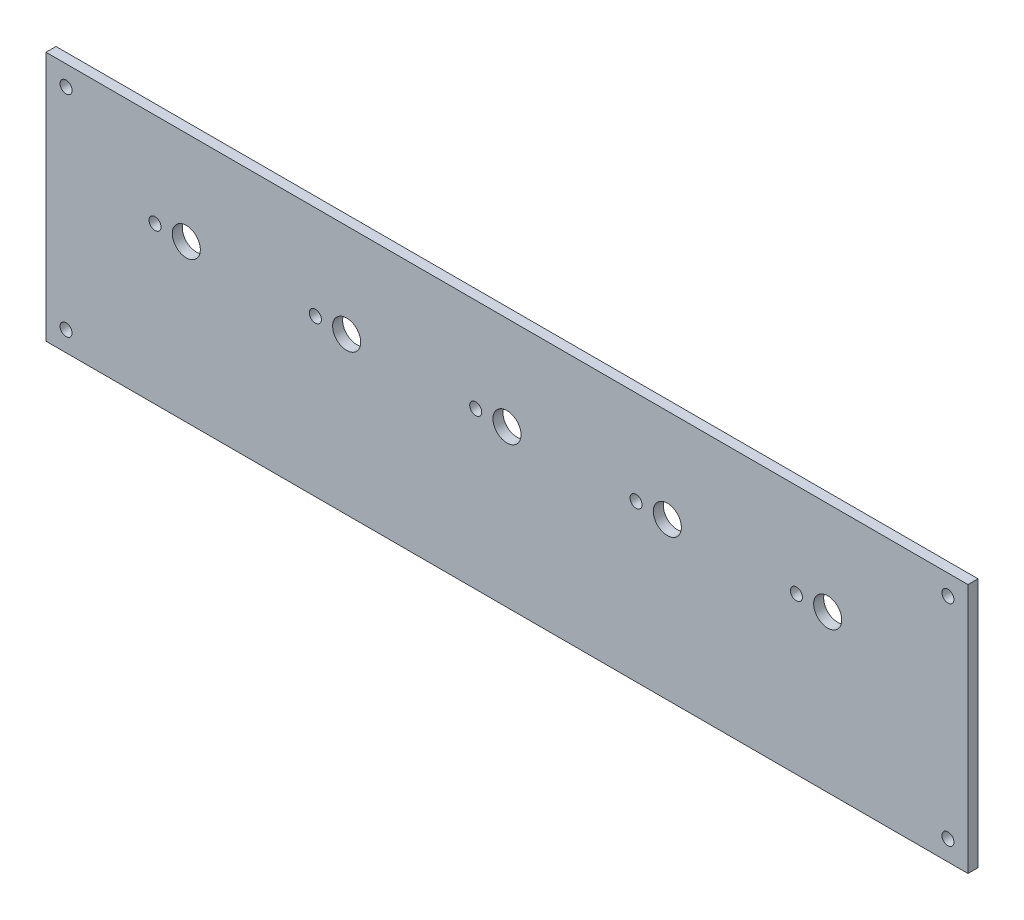
ISO-10303-21;
HEADER;
FILE_DESCRIPTION(('STEP AP214'),'2;1');
FILE_NAME('part.step','',(''),(''),'','','');
FILE_SCHEMA(('AUTOMOTIVE_DESIGN { 1 0 10303 214 1 1 1 1 }'));
ENDSEC;
DATA;
#1=APPLICATION_CONTEXT('core data for automotive mechanical design processes');
#2=APPLICATION_PROTOCOL_DEFINITION('international standard','automotive_design',2000,#1);
#3=PRODUCT_CONTEXT('',#1,'mechanical');
#4=PRODUCT('Part','Part','',(#3));
#5=PRODUCT_RELATED_PRODUCT_CATEGORY('part','',(#4));
#6=PRODUCT_DEFINITION_FORMATION('','',#4);
#7=PRODUCT_DEFINITION_CONTEXT('part definition',#1,'design');
#8=PRODUCT_DEFINITION('design','',#6,#7);
#9=PRODUCT_DEFINITION_SHAPE('','',#8);
#10=(LENGTH_UNIT() NAMED_UNIT(*) SI_UNIT(.MILLI.,.METRE.));
#11=(NAMED_UNIT(*) PLANE_ANGLE_UNIT() SI_UNIT($,.RADIAN.));
#12=(NAMED_UNIT(*) SI_UNIT($,.STERADIAN.) SOLID_ANGLE_UNIT());
#13=UNCERTAINTY_MEASURE_WITH_UNIT(LENGTH_MEASURE(1.E-05),#10,'distance_accuracy_value','');
#14=(GEOMETRIC_REPRESENTATION_CONTEXT(3) GLOBAL_UNCERTAINTY_ASSIGNED_CONTEXT((#13)) GLOBAL_UNIT_ASSIGNED_CONTEXT((#10,
#11,#12)) REPRESENTATION_CONTEXT('',''));
#15=CARTESIAN_POINT('',(0.,0.,0.));
#16=DIRECTION('',(0.,0.,1.));
#17=DIRECTION('',(1.,0.,0.));
#18=AXIS2_PLACEMENT_3D('',#15,#16,#17);
#19=CARTESIAN_POINT('',(0.,0.,2.5));
#20=DIRECTION('',(1.,0.,0.));
#21=DIRECTION('',(0.,0.,-1.));
#22=AXIS2_PLACEMENT_3D('',#19,#20,#21);
#23=PLANE('',#22);
#24=DIRECTION('',(0.,-1.,0.));
#25=VECTOR('',#24,1.);
#26=CARTESIAN_POINT('',(0.,0.,0.));
#27=LINE('',#26,#25);
#28=CARTESIAN_POINT('',(0.,62.43,0.));
#29=VERTEX_POINT('',#28);
#30=CARTESIAN_POINT('',(0.,0.,0.));
#31=VERTEX_POINT('',#30);
#32=EDGE_CURVE('E99',#29,#31,#27,.T.);
#33=ORIENTED_EDGE('',*,*,#32,.T.);
#34=DIRECTION('',(0.,0.,-1.));
#35=VECTOR('',#34,1.);
#36=CARTESIAN_POINT('',(0.,0.,2.5));
#37=LINE('',#36,#35);
#38=CARTESIAN_POINT('',(0.,0.,2.5));
#39=VERTEX_POINT('',#38);
#40=EDGE_CURVE('E11',#39,#31,#37,.T.);
#41=ORIENTED_EDGE('',*,*,#40,.F.);
#42=DIRECTION('',(0.,-1.,0.));
#43=VECTOR('',#42,1.);
#44=CARTESIAN_POINT('',(0.,0.,2.5));
#45=LINE('',#44,#43);
#46=CARTESIAN_POINT('',(0.,62.43,2.5));
#47=VERTEX_POINT('',#46);
#48=EDGE_CURVE('E86',#47,#39,#45,.T.);
#49=ORIENTED_EDGE('',*,*,#48,.F.);
#50=DIRECTION('',(0.,0.,-1.));
#51=VECTOR('',#50,1.);
#52=CARTESIAN_POINT('',(0.,62.43,2.5));
#53=LINE('',#52,#51);
#54=EDGE_CURVE('E95',#47,#29,#53,.T.);
#55=ORIENTED_EDGE('',*,*,#54,.T.);
#56=EDGE_LOOP('',(#33,#41,#49,#55));
#57=FACE_BOUND('',#56,.T.);
#58=ADVANCED_FACE('F33',(#57),#23,.F.);
#59=CARTESIAN_POINT('',(0.,0.,2.5));
#60=DIRECTION('',(0.,1.,0.));
#61=DIRECTION('',(0.,0.,1.));
#62=AXIS2_PLACEMENT_3D('',#59,#60,#61);
#63=PLANE('',#62);
#64=DIRECTION('',(1.,0.,0.));
#65=VECTOR('',#64,1.);
#66=CARTESIAN_POINT('',(0.,0.,0.));
#67=LINE('',#66,#65);
#68=CARTESIAN_POINT('',(230.,0.,0.));
#69=VERTEX_POINT('',#68);
#70=EDGE_CURVE('E90',#31,#69,#67,.T.);
#71=ORIENTED_EDGE('',*,*,#70,.T.);
#72=DIRECTION('',(0.,0.,-1.));
#73=VECTOR('',#72,1.);
#74=CARTESIAN_POINT('',(230.,0.,2.5));
#75=LINE('',#74,#73);
#76=CARTESIAN_POINT('',(230.,0.,2.5));
#77=VERTEX_POINT('',#76);
#78=EDGE_CURVE('E42',#77,#69,#75,.T.);
#79=ORIENTED_EDGE('',*,*,#78,.F.);
#80=DIRECTION('',(1.,0.,0.));
#81=VECTOR('',#80,1.);
#82=CARTESIAN_POINT('',(0.,0.,2.5));
#83=LINE('',#82,#81);
#84=EDGE_CURVE('E81',#39,#77,#83,.T.);
#85=ORIENTED_EDGE('',*,*,#84,.F.);
#86=ORIENTED_EDGE('',*,*,#40,.T.);
#87=EDGE_LOOP('',(#71,#79,#85,#86));
#88=FACE_BOUND('',#87,.T.);
#89=ADVANCED_FACE('F89',(#88),#63,.F.);
#90=CARTESIAN_POINT('',(230.,0.,2.5));
#91=DIRECTION('',(-1.,0.,0.));
#92=DIRECTION('',(0.,0.,1.));
#93=AXIS2_PLACEMENT_3D('',#90,#91,#92);
#94=PLANE('',#93);
#95=DIRECTION('',(0.,1.,0.));
#96=VECTOR('',#95,1.);
#97=CARTESIAN_POINT('',(230.,0.,0.));
#98=LINE('',#97,#96);
#99=CARTESIAN_POINT('',(230.,62.43,0.));
#100=VERTEX_POINT('',#99);
#101=EDGE_CURVE('E68',#69,#100,#98,.T.);
#102=ORIENTED_EDGE('',*,*,#101,.T.);
#103=DIRECTION('',(0.,0.,-1.));
#104=VECTOR('',#103,1.);
#105=CARTESIAN_POINT('',(230.,62.43,2.5));
#106=LINE('',#105,#104);
#107=CARTESIAN_POINT('',(230.,62.43,2.5));
#108=VERTEX_POINT('',#107);
#109=EDGE_CURVE('E91',#108,#100,#106,.T.);
#110=ORIENTED_EDGE('',*,*,#109,.F.);
#111=DIRECTION('',(0.,1.,0.));
#112=VECTOR('',#111,1.);
#113=CARTESIAN_POINT('',(230.,0.,2.5));
#114=LINE('',#113,#112);
#115=EDGE_CURVE('E84',#77,#108,#114,.T.);
#116=ORIENTED_EDGE('',*,*,#115,.F.);
#117=ORIENTED_EDGE('',*,*,#78,.T.);
#118=EDGE_LOOP('',(#102,#110,#116,#117));
#119=FACE_BOUND('',#118,.T.);
#120=ADVANCED_FACE('F93',(#119),#94,.F.);
#121=CARTESIAN_POINT('',(0.,62.43,2.5));
#122=DIRECTION('',(0.,-1.,0.));
#123=DIRECTION('',(0.,0.,-1.));
#124=AXIS2_PLACEMENT_3D('',#121,#122,#123);
#125=PLANE('',#124);
#126=DIRECTION('',(-1.,0.,0.));
#127=VECTOR('',#126,1.);
#128=CARTESIAN_POINT('',(0.,62.43,0.));
#129=LINE('',#128,#127);
#130=EDGE_CURVE('E74',#100,#29,#129,.T.);
#131=ORIENTED_EDGE('',*,*,#130,.T.);
#132=ORIENTED_EDGE('',*,*,#54,.F.);
#133=DIRECTION('',(-1.,0.,0.));
#134=VECTOR('',#133,1.);
#135=CARTESIAN_POINT('',(0.,62.43,2.5));
#136=LINE('',#135,#134);
#137=EDGE_CURVE('E51',#108,#47,#136,.T.);
#138=ORIENTED_EDGE('',*,*,#137,.F.);
#139=ORIENTED_EDGE('',*,*,#109,.T.);
#140=EDGE_LOOP('',(#131,#132,#138,#139));
#141=FACE_BOUND('',#140,.T.);
#142=ADVANCED_FACE('F136',(#141),#125,.F.);
#143=CARTESIAN_POINT('',(0.,0.,2.5));
#144=DIRECTION('',(0.,0.,-1.));
#145=DIRECTION('',(-1.,0.,0.));
#146=AXIS2_PLACEMENT_3D('',#143,#144,#145);
#147=PLANE('',#146);
#148=CARTESIAN_POINT('',(27.2,39.0187499999994,2.5));
#149=DIRECTION('',(0.,0.,1.));
#150=DIRECTION('',(1.,0.,0.));
#151=AXIS2_PLACEMENT_3D('',#148,#149,#150);
#152=CIRCLE('',#151,1.5);
#153=CARTESIAN_POINT('',(28.7,39.0187499999994,2.5));
#154=VERTEX_POINT('',#153);
#155=EDGE_CURVE('E315',#154,#154,#152,.T.);
#156=ORIENTED_EDGE('',*,*,#155,.F.);
#157=EDGE_LOOP('',(#156));
#158=FACE_BOUND('',#157,.T.);
#159=CARTESIAN_POINT('',(195.,39.01875,2.5));
#160=DIRECTION('',(0.,0.,1.));
#161=DIRECTION('',(1.,0.,0.));
#162=AXIS2_PLACEMENT_3D('',#159,#160,#161);
#163=CIRCLE('',#162,3.49999999999999);
#164=CARTESIAN_POINT('',(198.5,39.01875,2.5));
#165=VERTEX_POINT('',#164);
#166=EDGE_CURVE('E404',#165,#165,#163,.T.);
#167=ORIENTED_EDGE('',*,*,#166,.F.);
#168=EDGE_LOOP('',(#167));
#169=FACE_BOUND('',#168,.T.);
#170=CARTESIAN_POINT('',(147.2,39.01875,2.5));
#171=DIRECTION('',(0.,0.,1.));
#172=DIRECTION('',(1.,0.,0.));
#173=AXIS2_PLACEMENT_3D('',#170,#171,#172);
#174=CIRCLE('',#173,1.5);
#175=CARTESIAN_POINT('',(148.7,39.01875,2.5));
#176=VERTEX_POINT('',#175);
#177=EDGE_CURVE('E398',#176,#176,#174,.T.);
#178=ORIENTED_EDGE('',*,*,#177,.F.);
#179=EDGE_LOOP('',(#178));
#180=FACE_BOUND('',#179,.T.);
#181=CARTESIAN_POINT('',(155.,39.01875,2.5));
#182=DIRECTION('',(0.,0.,1.));
#183=DIRECTION('',(1.,0.,0.));
#184=AXIS2_PLACEMENT_3D('',#181,#182,#183);
#185=CIRCLE('',#184,3.49999999999999);
#186=CARTESIAN_POINT('',(158.5,39.01875,2.5));
#187=VERTEX_POINT('',#186);
#188=EDGE_CURVE('E369',#187,#187,#185,.T.);
#189=ORIENTED_EDGE('',*,*,#188,.F.);
#190=EDGE_LOOP('',(#189));
#191=FACE_BOUND('',#190,.T.);
#192=CARTESIAN_POINT('',(107.2,39.01875,2.5));
#193=DIRECTION('',(0.,0.,1.));
#194=DIRECTION('',(1.,0.,0.));
#195=AXIS2_PLACEMENT_3D('',#192,#193,#194);
#196=CIRCLE('',#195,1.5);
#197=CARTESIAN_POINT('',(108.7,39.01875,2.5));
#198=VERTEX_POINT('',#197);
#199=EDGE_CURVE('E360',#198,#198,#196,.T.);
#200=ORIENTED_EDGE('',*,*,#199,.F.);
#201=EDGE_LOOP('',(#200));
#202=FACE_BOUND('',#201,.T.);
#203=CARTESIAN_POINT('',(187.2,39.01875,2.5));
#204=DIRECTION('',(0.,0.,1.));
#205=DIRECTION('',(1.,0.,0.));
#206=AXIS2_PLACEMENT_3D('',#203,#204,#205);
#207=CIRCLE('',#206,1.5);
#208=CARTESIAN_POINT('',(188.7,39.01875,2.5));
#209=VERTEX_POINT('',#208);
#210=EDGE_CURVE('E414',#209,#209,#207,.T.);
#211=ORIENTED_EDGE('',*,*,#210,.F.);
#212=EDGE_LOOP('',(#211));
#213=FACE_BOUND('',#212,.T.);
#214=CARTESIAN_POINT('',(75.,39.0187499999997,2.5));
#215=DIRECTION('',(0.,0.,1.));
#216=DIRECTION('',(1.,0.,0.));
#217=AXIS2_PLACEMENT_3D('',#214,#215,#216);
#218=CIRCLE('',#217,3.50000000000001);
#219=CARTESIAN_POINT('',(78.5,39.0187499999997,2.5));
#220=VERTEX_POINT('',#219);
#221=EDGE_CURVE('E419',#220,#220,#218,.T.);
#222=ORIENTED_EDGE('',*,*,#221,.F.);
#223=EDGE_LOOP('',(#222));
#224=FACE_BOUND('',#223,.T.);
#225=CARTESIAN_POINT('',(67.2,39.0187499999997,2.5));
#226=DIRECTION('',(0.,0.,1.));
#227=DIRECTION('',(1.,0.,0.));
#228=AXIS2_PLACEMENT_3D('',#225,#226,#227);
#229=CIRCLE('',#228,1.5);
#230=CARTESIAN_POINT('',(68.7,39.0187499999997,2.5));
#231=VERTEX_POINT('',#230);
#232=EDGE_CURVE('E392',#231,#231,#229,.T.);
#233=ORIENTED_EDGE('',*,*,#232,.F.);
#234=EDGE_LOOP('',(#233));
#235=FACE_BOUND('',#234,.T.);
#236=CARTESIAN_POINT('',(35.,39.0187499999994,2.5));
#237=DIRECTION('',(0.,0.,1.));
#238=DIRECTION('',(1.,0.,0.));
#239=AXIS2_PLACEMENT_3D('',#236,#237,#238);
#240=CIRCLE('',#239,3.5);
#241=CARTESIAN_POINT('',(38.5,39.0187499999994,2.5));
#242=VERTEX_POINT('',#241);
#243=EDGE_CURVE('E319',#242,#242,#240,.T.);
#244=ORIENTED_EDGE('',*,*,#243,.F.);
#245=EDGE_LOOP('',(#244));
#246=FACE_BOUND('',#245,.T.);
#247=CARTESIAN_POINT('',(115.,39.01875,2.5));
#248=DIRECTION('',(0.,0.,1.));
#249=DIRECTION('',(1.,0.,0.));
#250=AXIS2_PLACEMENT_3D('',#247,#248,#249);
#251=CIRCLE('',#250,3.50000000000001);
#252=CARTESIAN_POINT('',(118.5,39.01875,2.5));
#253=VERTEX_POINT('',#252);
#254=EDGE_CURVE('E327',#253,#253,#251,.T.);
#255=ORIENTED_EDGE('',*,*,#254,.F.);
#256=EDGE_LOOP('',(#255));
#257=FACE_BOUND('',#256,.T.);
#258=CARTESIAN_POINT('',(225.,57.43,2.5));
#259=DIRECTION('',(0.,0.,1.));
#260=DIRECTION('',(-1.,0.,0.));
#261=AXIS2_PLACEMENT_3D('',#258,#259,#260);
#262=CIRCLE('',#261,1.5);
#263=CARTESIAN_POINT('',(223.5,57.43,2.5));
#264=VERTEX_POINT('',#263);
#265=EDGE_CURVE('E334',#264,#264,#262,.T.);
#266=ORIENTED_EDGE('',*,*,#265,.F.);
#267=EDGE_LOOP('',(#266));
#268=FACE_BOUND('',#267,.T.);
#269=CARTESIAN_POINT('',(225.,5.,2.5));
#270=DIRECTION('',(0.,0.,1.));
#271=DIRECTION('',(1.,0.,0.));
#272=AXIS2_PLACEMENT_3D('',#269,#270,#271);
#273=CIRCLE('',#272,1.5);
#274=CARTESIAN_POINT('',(226.5,5.,2.5));
#275=VERTEX_POINT('',#274);
#276=EDGE_CURVE('E338',#275,#275,#273,.T.);
#277=ORIENTED_EDGE('',*,*,#276,.F.);
#278=EDGE_LOOP('',(#277));
#279=FACE_BOUND('',#278,.T.);
#280=CARTESIAN_POINT('',(5.,5.,2.5));
#281=DIRECTION('',(0.,0.,1.));
#282=DIRECTION('',(-1.,0.,0.));
#283=AXIS2_PLACEMENT_3D('',#280,#281,#282);
#284=CIRCLE('',#283,1.5);
#285=CARTESIAN_POINT('',(3.5,5.,2.5));
#286=VERTEX_POINT('',#285);
#287=EDGE_CURVE('E335',#286,#286,#284,.T.);
#288=ORIENTED_EDGE('',*,*,#287,.F.);
#289=EDGE_LOOP('',(#288));
#290=FACE_BOUND('',#289,.T.);
#291=CARTESIAN_POINT('',(5.,57.43,2.5));
#292=DIRECTION('',(0.,0.,1.));
#293=DIRECTION('',(1.,0.,0.));
#294=AXIS2_PLACEMENT_3D('',#291,#292,#293);
#295=CIRCLE('',#294,1.5);
#296=CARTESIAN_POINT('',(6.5,57.43,2.5));
#297=VERTEX_POINT('',#296);
#298=EDGE_CURVE('E111',#297,#297,#295,.T.);
#299=ORIENTED_EDGE('',*,*,#298,.F.);
#300=EDGE_LOOP('',(#299));
#301=FACE_BOUND('',#300,.T.);
#302=ORIENTED_EDGE('',*,*,#48,.T.);
#303=ORIENTED_EDGE('',*,*,#84,.T.);
#304=ORIENTED_EDGE('',*,*,#115,.T.);
#305=ORIENTED_EDGE('',*,*,#137,.T.);
#306=EDGE_LOOP('',(#302,#303,#304,#305));
#307=FACE_BOUND('',#306,.T.);
#308=ADVANCED_FACE('F82',(#158,#169,#180,#191,#202,#213,#224,#235,#246,#257,#268,#279,#290,#301,
#307),#147,.F.);
#309=CARTESIAN_POINT('',(0.,0.,0.));
#310=DIRECTION('',(0.,0.,-1.));
#311=DIRECTION('',(-1.,0.,0.));
#312=AXIS2_PLACEMENT_3D('',#309,#310,#311);
#313=PLANE('',#312);
#314=CARTESIAN_POINT('',(27.2,39.0187499999994,0.));
#315=DIRECTION('',(0.,0.,-1.));
#316=DIRECTION('',(-1.,0.,0.));
#317=AXIS2_PLACEMENT_3D('',#314,#315,#316);
#318=CIRCLE('',#317,1.5);
#319=CARTESIAN_POINT('',(25.7,39.0187499999994,0.));
#320=VERTEX_POINT('',#319);
#321=EDGE_CURVE('E318',#320,#320,#318,.F.);
#322=ORIENTED_EDGE('',*,*,#321,.T.);
#323=EDGE_LOOP('',(#322));
#324=FACE_BOUND('',#323,.T.);
#325=CARTESIAN_POINT('',(195.,39.01875,0.));
#326=DIRECTION('',(0.,0.,-1.));
#327=DIRECTION('',(-1.,0.,0.));
#328=AXIS2_PLACEMENT_3D('',#325,#326,#327);
#329=CIRCLE('',#328,3.49999999999999);
#330=CARTESIAN_POINT('',(191.5,39.01875,0.));
#331=VERTEX_POINT('',#330);
#332=EDGE_CURVE('E401',#331,#331,#329,.F.);
#333=ORIENTED_EDGE('',*,*,#332,.T.);
#334=EDGE_LOOP('',(#333));
#335=FACE_BOUND('',#334,.T.);
#336=CARTESIAN_POINT('',(147.2,39.01875,0.));
#337=DIRECTION('',(0.,0.,-1.));
#338=DIRECTION('',(-1.,0.,0.));
#339=AXIS2_PLACEMENT_3D('',#336,#337,#338);
#340=CIRCLE('',#339,1.5);
#341=CARTESIAN_POINT('',(145.7,39.01875,0.));
#342=VERTEX_POINT('',#341);
#343=EDGE_CURVE('E371',#342,#342,#340,.F.);
#344=ORIENTED_EDGE('',*,*,#343,.T.);
#345=EDGE_LOOP('',(#344));
#346=FACE_BOUND('',#345,.T.);
#347=CARTESIAN_POINT('',(155.,39.01875,0.));
#348=DIRECTION('',(0.,0.,-1.));
#349=DIRECTION('',(-1.,0.,0.));
#350=AXIS2_PLACEMENT_3D('',#347,#348,#349);
#351=CIRCLE('',#350,3.49999999999999);
#352=CARTESIAN_POINT('',(151.5,39.01875,0.));
#353=VERTEX_POINT('',#352);
#354=EDGE_CURVE('E365',#353,#353,#351,.F.);
#355=ORIENTED_EDGE('',*,*,#354,.T.);
#356=EDGE_LOOP('',(#355));
#357=FACE_BOUND('',#356,.T.);
#358=CARTESIAN_POINT('',(107.2,39.01875,0.));
#359=DIRECTION('',(0.,0.,-1.));
#360=DIRECTION('',(-1.,0.,0.));
#361=AXIS2_PLACEMENT_3D('',#358,#359,#360);
#362=CIRCLE('',#361,1.5);
#363=CARTESIAN_POINT('',(105.7,39.01875,0.));
#364=VERTEX_POINT('',#363);
#365=EDGE_CURVE('E331',#364,#364,#362,.F.);
#366=ORIENTED_EDGE('',*,*,#365,.T.);
#367=EDGE_LOOP('',(#366));
#368=FACE_BOUND('',#367,.T.);
#369=CARTESIAN_POINT('',(187.2,39.01875,0.));
#370=DIRECTION('',(0.,0.,-1.));
#371=DIRECTION('',(-1.,0.,0.));
#372=AXIS2_PLACEMENT_3D('',#369,#370,#371);
#373=CIRCLE('',#372,1.5);
#374=CARTESIAN_POINT('',(185.7,39.01875,0.));
#375=VERTEX_POINT('',#374);
#376=EDGE_CURVE('E380',#375,#375,#373,.F.);
#377=ORIENTED_EDGE('',*,*,#376,.T.);
#378=EDGE_LOOP('',(#377));
#379=FACE_BOUND('',#378,.T.);
#380=CARTESIAN_POINT('',(75.,39.0187499999997,0.));
#381=DIRECTION('',(0.,0.,-1.));
#382=DIRECTION('',(-1.,0.,0.));
#383=AXIS2_PLACEMENT_3D('',#380,#381,#382);
#384=CIRCLE('',#383,3.50000000000001);
#385=CARTESIAN_POINT('',(71.5,39.0187499999997,0.));
#386=VERTEX_POINT('',#385);
#387=EDGE_CURVE('E384',#386,#386,#384,.F.);
#388=ORIENTED_EDGE('',*,*,#387,.T.);
#389=EDGE_LOOP('',(#388));
#390=FACE_BOUND('',#389,.T.);
#391=CARTESIAN_POINT('',(67.2,39.0187499999997,0.));
#392=DIRECTION('',(0.,0.,-1.));
#393=DIRECTION('',(-1.,0.,0.));
#394=AXIS2_PLACEMENT_3D('',#391,#392,#393);
#395=CIRCLE('',#394,1.5);
#396=CARTESIAN_POINT('',(65.7,39.0187499999997,0.));
#397=VERTEX_POINT('',#396);
#398=EDGE_CURVE('E388',#397,#397,#395,.F.);
#399=ORIENTED_EDGE('',*,*,#398,.T.);
#400=EDGE_LOOP('',(#399));
#401=FACE_BOUND('',#400,.T.);
#402=CARTESIAN_POINT('',(35.,39.0187499999994,0.));
#403=DIRECTION('',(0.,0.,-1.));
#404=DIRECTION('',(-1.,0.,0.));
#405=AXIS2_PLACEMENT_3D('',#402,#403,#404);
#406=CIRCLE('',#405,3.5);
#407=CARTESIAN_POINT('',(31.5,39.0187499999994,0.));
#408=VERTEX_POINT('',#407);
#409=EDGE_CURVE('E322',#408,#408,#406,.F.);
#410=ORIENTED_EDGE('',*,*,#409,.T.);
#411=EDGE_LOOP('',(#410));
#412=FACE_BOUND('',#411,.T.);
#413=CARTESIAN_POINT('',(115.,39.01875,0.));
#414=DIRECTION('',(0.,0.,-1.));
#415=DIRECTION('',(-1.,0.,0.));
#416=AXIS2_PLACEMENT_3D('',#413,#414,#415);
#417=CIRCLE('',#416,3.50000000000001);
#418=CARTESIAN_POINT('',(111.5,39.01875,0.));
#419=VERTEX_POINT('',#418);
#420=EDGE_CURVE('E330',#419,#419,#417,.F.);
#421=ORIENTED_EDGE('',*,*,#420,.T.);
#422=EDGE_LOOP('',(#421));
#423=FACE_BOUND('',#422,.T.);
#424=CARTESIAN_POINT('',(225.,57.43,0.));
#425=DIRECTION('',(0.,0.,-1.));
#426=DIRECTION('',(-1.,0.,0.));
#427=AXIS2_PLACEMENT_3D('',#424,#425,#426);
#428=CIRCLE('',#427,1.5);
#429=CARTESIAN_POINT('',(223.5,57.43,0.));
#430=VERTEX_POINT('',#429);
#431=EDGE_CURVE('E36',#430,#430,#428,.T.);
#432=ORIENTED_EDGE('',*,*,#431,.F.);
#433=EDGE_LOOP('',(#432));
#434=FACE_BOUND('',#433,.T.);
#435=CARTESIAN_POINT('',(225.,5.,0.));
#436=DIRECTION('',(0.,0.,-1.));
#437=DIRECTION('',(-1.,0.,0.));
#438=AXIS2_PLACEMENT_3D('',#435,#436,#437);
#439=CIRCLE('',#438,1.5);
#440=CARTESIAN_POINT('',(223.5,5.,0.));
#441=VERTEX_POINT('',#440);
#442=EDGE_CURVE('E113',#441,#441,#439,.T.);
#443=ORIENTED_EDGE('',*,*,#442,.F.);
#444=EDGE_LOOP('',(#443));
#445=FACE_BOUND('',#444,.T.);
#446=CARTESIAN_POINT('',(5.,5.,0.));
#447=DIRECTION('',(0.,0.,-1.));
#448=DIRECTION('',(-1.,0.,0.));
#449=AXIS2_PLACEMENT_3D('',#446,#447,#448);
#450=CIRCLE('',#449,1.5);
#451=CARTESIAN_POINT('',(3.5,5.,0.));
#452=VERTEX_POINT('',#451);
#453=EDGE_CURVE('E110',#452,#452,#450,.T.);
#454=ORIENTED_EDGE('',*,*,#453,.F.);
#455=EDGE_LOOP('',(#454));
#456=FACE_BOUND('',#455,.T.);
#457=CARTESIAN_POINT('',(5.,57.43,0.));
#458=DIRECTION('',(0.,0.,-1.));
#459=DIRECTION('',(-1.,0.,0.));
#460=AXIS2_PLACEMENT_3D('',#457,#458,#459);
#461=CIRCLE('',#460,1.5);
#462=CARTESIAN_POINT('',(3.5,57.43,0.));
#463=VERTEX_POINT('',#462);
#464=EDGE_CURVE('E107',#463,#463,#461,.T.);
#465=ORIENTED_EDGE('',*,*,#464,.F.);
#466=EDGE_LOOP('',(#465));
#467=FACE_BOUND('',#466,.T.);
#468=ORIENTED_EDGE('',*,*,#32,.F.);
#469=ORIENTED_EDGE('',*,*,#130,.F.);
#470=ORIENTED_EDGE('',*,*,#101,.F.);
#471=ORIENTED_EDGE('',*,*,#70,.F.);
#472=EDGE_LOOP('',(#468,#469,#470,#471));
#473=FACE_BOUND('',#472,.T.);
#474=ADVANCED_FACE('F123',(#324,#335,#346,#357,#368,#379,#390,#401,#412,#423,#434,#445,#456,
#467,#473),#313,.T.);
#475=CARTESIAN_POINT('',(5.,57.43,-7.5));
#476=DIRECTION('',(0.,0.,1.));
#477=DIRECTION('',(1.,0.,0.));
#478=AXIS2_PLACEMENT_3D('',#475,#476,#477);
#479=CYLINDRICAL_SURFACE('',#478,1.5);
#480=ORIENTED_EDGE('',*,*,#464,.T.);
#481=EDGE_LOOP('',(#480));
#482=FACE_BOUND('',#481,.T.);
#483=ORIENTED_EDGE('',*,*,#298,.T.);
#484=EDGE_LOOP('',(#483));
#485=FACE_BOUND('',#484,.T.);
#486=ADVANCED_FACE('F126',(#482,#485),#479,.F.);
#487=CARTESIAN_POINT('',(5.,5.,-7.5));
#488=DIRECTION('',(0.,0.,1.));
#489=DIRECTION('',(1.,0.,0.));
#490=AXIS2_PLACEMENT_3D('',#487,#488,#489);
#491=CYLINDRICAL_SURFACE('',#490,1.5);
#492=ORIENTED_EDGE('',*,*,#453,.T.);
#493=EDGE_LOOP('',(#492));
#494=FACE_BOUND('',#493,.T.);
#495=ORIENTED_EDGE('',*,*,#287,.T.);
#496=EDGE_LOOP('',(#495));
#497=FACE_BOUND('',#496,.T.);
#498=ADVANCED_FACE('F170',(#494,#497),#491,.F.);
#499=CARTESIAN_POINT('',(225.,5.,-7.5));
#500=DIRECTION('',(0.,0.,1.));
#501=DIRECTION('',(1.,0.,0.));
#502=AXIS2_PLACEMENT_3D('',#499,#500,#501);
#503=CYLINDRICAL_SURFACE('',#502,1.5);
#504=ORIENTED_EDGE('',*,*,#442,.T.);
#505=EDGE_LOOP('',(#504));
#506=FACE_BOUND('',#505,.T.);
#507=ORIENTED_EDGE('',*,*,#276,.T.);
#508=EDGE_LOOP('',(#507));
#509=FACE_BOUND('',#508,.T.);
#510=ADVANCED_FACE('F181',(#506,#509),#503,.F.);
#511=CARTESIAN_POINT('',(225.,57.43,-7.5));
#512=DIRECTION('',(0.,0.,1.));
#513=DIRECTION('',(1.,0.,0.));
#514=AXIS2_PLACEMENT_3D('',#511,#512,#513);
#515=CYLINDRICAL_SURFACE('',#514,1.5);
#516=ORIENTED_EDGE('',*,*,#431,.T.);
#517=EDGE_LOOP('',(#516));
#518=FACE_BOUND('',#517,.T.);
#519=ORIENTED_EDGE('',*,*,#265,.T.);
#520=EDGE_LOOP('',(#519));
#521=FACE_BOUND('',#520,.T.);
#522=ADVANCED_FACE('F120',(#518,#521),#515,.F.);
#523=CARTESIAN_POINT('',(115.,39.01875,-9.89949493661168));
#524=DIRECTION('',(0.,0.,1.));
#525=DIRECTION('',(1.,0.,0.));
#526=AXIS2_PLACEMENT_3D('',#523,#524,#525);
#527=CYLINDRICAL_SURFACE('',#526,3.50000000000001);
#528=ORIENTED_EDGE('',*,*,#254,.T.);
#529=EDGE_LOOP('',(#528));
#530=FACE_BOUND('',#529,.T.);
#531=ORIENTED_EDGE('',*,*,#420,.F.);
#532=EDGE_LOOP('',(#531));
#533=FACE_BOUND('',#532,.T.);
#534=ADVANCED_FACE('F199',(#530,#533),#527,.F.);
#535=CARTESIAN_POINT('',(35.,39.0187499999994,-9.89949493661168));
#536=DIRECTION('',(0.,0.,1.));
#537=DIRECTION('',(1.,0.,0.));
#538=AXIS2_PLACEMENT_3D('',#535,#536,#537);
#539=CYLINDRICAL_SURFACE('',#538,3.5);
#540=ORIENTED_EDGE('',*,*,#243,.T.);
#541=EDGE_LOOP('',(#540));
#542=FACE_BOUND('',#541,.T.);
#543=ORIENTED_EDGE('',*,*,#409,.F.);
#544=EDGE_LOOP('',(#543));
#545=FACE_BOUND('',#544,.T.);
#546=ADVANCED_FACE('F218',(#542,#545),#539,.F.);
#547=CARTESIAN_POINT('',(67.2,39.0187499999997,-9.89949493661168));
#548=DIRECTION('',(0.,0.,1.));
#549=DIRECTION('',(1.,0.,0.));
#550=AXIS2_PLACEMENT_3D('',#547,#548,#549);
#551=CYLINDRICAL_SURFACE('',#550,1.5);
#552=ORIENTED_EDGE('',*,*,#232,.T.);
#553=EDGE_LOOP('',(#552));
#554=FACE_BOUND('',#553,.T.);
#555=ORIENTED_EDGE('',*,*,#398,.F.);
#556=EDGE_LOOP('',(#555));
#557=FACE_BOUND('',#556,.T.);
#558=ADVANCED_FACE('F228',(#554,#557),#551,.F.);
#559=CARTESIAN_POINT('',(75.,39.0187499999997,-9.89949493661168));
#560=DIRECTION('',(0.,0.,1.));
#561=DIRECTION('',(1.,0.,0.));
#562=AXIS2_PLACEMENT_3D('',#559,#560,#561);
#563=CYLINDRICAL_SURFACE('',#562,3.50000000000001);
#564=ORIENTED_EDGE('',*,*,#221,.T.);
#565=EDGE_LOOP('',(#564));
#566=FACE_BOUND('',#565,.T.);
#567=ORIENTED_EDGE('',*,*,#387,.F.);
#568=EDGE_LOOP('',(#567));
#569=FACE_BOUND('',#568,.T.);
#570=ADVANCED_FACE('F238',(#566,#569),#563,.F.);
#571=CARTESIAN_POINT('',(187.2,39.01875,-9.89949493661168));
#572=DIRECTION('',(0.,0.,1.));
#573=DIRECTION('',(1.,0.,0.));
#574=AXIS2_PLACEMENT_3D('',#571,#572,#573);
#575=CYLINDRICAL_SURFACE('',#574,1.5);
#576=ORIENTED_EDGE('',*,*,#210,.T.);
#577=EDGE_LOOP('',(#576));
#578=FACE_BOUND('',#577,.T.);
#579=ORIENTED_EDGE('',*,*,#376,.F.);
#580=EDGE_LOOP('',(#579));
#581=FACE_BOUND('',#580,.T.);
#582=ADVANCED_FACE('F248',(#578,#581),#575,.F.);
#583=CARTESIAN_POINT('',(107.2,39.01875,-9.89949493661168));
#584=DIRECTION('',(0.,0.,1.));
#585=DIRECTION('',(1.,0.,0.));
#586=AXIS2_PLACEMENT_3D('',#583,#584,#585);
#587=CYLINDRICAL_SURFACE('',#586,1.5);
#588=ORIENTED_EDGE('',*,*,#199,.T.);
#589=EDGE_LOOP('',(#588));
#590=FACE_BOUND('',#589,.T.);
#591=ORIENTED_EDGE('',*,*,#365,.F.);
#592=EDGE_LOOP('',(#591));
#593=FACE_BOUND('',#592,.T.);
#594=ADVANCED_FACE('F258',(#590,#593),#587,.F.);
#595=CARTESIAN_POINT('',(155.,39.01875,-9.89949493661168));
#596=DIRECTION('',(0.,0.,1.));
#597=DIRECTION('',(1.,0.,0.));
#598=AXIS2_PLACEMENT_3D('',#595,#596,#597);
#599=CYLINDRICAL_SURFACE('',#598,3.49999999999999);
#600=ORIENTED_EDGE('',*,*,#188,.T.);
#601=EDGE_LOOP('',(#600));
#602=FACE_BOUND('',#601,.T.);
#603=ORIENTED_EDGE('',*,*,#354,.F.);
#604=EDGE_LOOP('',(#603));
#605=FACE_BOUND('',#604,.T.);
#606=ADVANCED_FACE('F268',(#602,#605),#599,.F.);
#607=CARTESIAN_POINT('',(147.2,39.01875,-9.89949493661168));
#608=DIRECTION('',(0.,0.,1.));
#609=DIRECTION('',(1.,0.,0.));
#610=AXIS2_PLACEMENT_3D('',#607,#608,#609);
#611=CYLINDRICAL_SURFACE('',#610,1.5);
#612=ORIENTED_EDGE('',*,*,#177,.T.);
#613=EDGE_LOOP('',(#612));
#614=FACE_BOUND('',#613,.T.);
#615=ORIENTED_EDGE('',*,*,#343,.F.);
#616=EDGE_LOOP('',(#615));
#617=FACE_BOUND('',#616,.T.);
#618=ADVANCED_FACE('F278',(#614,#617),#611,.F.);
#619=CARTESIAN_POINT('',(195.,39.01875,-9.89949493661168));
#620=DIRECTION('',(0.,0.,1.));
#621=DIRECTION('',(1.,0.,0.));
#622=AXIS2_PLACEMENT_3D('',#619,#620,#621);
#623=CYLINDRICAL_SURFACE('',#622,3.49999999999999);
#624=ORIENTED_EDGE('',*,*,#166,.T.);
#625=EDGE_LOOP('',(#624));
#626=FACE_BOUND('',#625,.T.);
#627=ORIENTED_EDGE('',*,*,#332,.F.);
#628=EDGE_LOOP('',(#627));
#629=FACE_BOUND('',#628,.T.);
#630=ADVANCED_FACE('F288',(#626,#629),#623,.F.);
#631=CARTESIAN_POINT('',(27.2,39.0187499999994,-9.89949493661168));
#632=DIRECTION('',(0.,0.,1.));
#633=DIRECTION('',(1.,0.,0.));
#634=AXIS2_PLACEMENT_3D('',#631,#632,#633);
#635=CYLINDRICAL_SURFACE('',#634,1.5);
#636=ORIENTED_EDGE('',*,*,#155,.T.);
#637=EDGE_LOOP('',(#636));
#638=FACE_BOUND('',#637,.T.);
#639=ORIENTED_EDGE('',*,*,#321,.F.);
#640=EDGE_LOOP('',(#639));
#641=FACE_BOUND('',#640,.T.);
#642=ADVANCED_FACE('F298',(#638,#641),#635,.F.);
#643=CLOSED_SHELL('',(#58,#89,#120,#142,#308,#474,#486,#498,#510,#522,#534,#546,#558,#570,#582,
#594,#606,#618,#630,#642));
#644=MANIFOLD_SOLID_BREP('B2',#643);
#645=ADVANCED_BREP_SHAPE_REPRESENTATION('',(#18,#644),#14);
#646=SHAPE_DEFINITION_REPRESENTATION(#9,#645);
ENDSEC;
END-ISO-10303-21;
